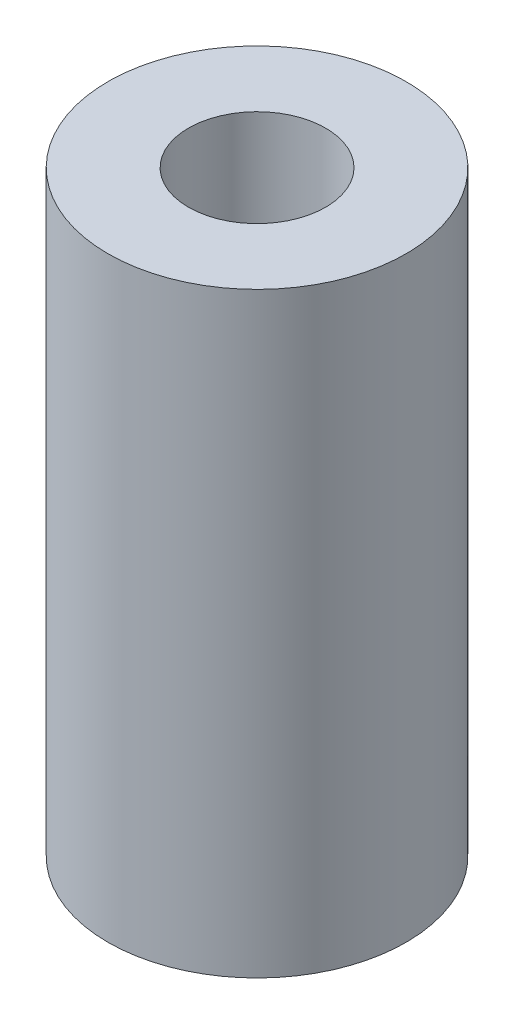
ISO-10303-21;
HEADER;
FILE_DESCRIPTION(('STEP AP214'),'2;1');
FILE_NAME('part.step','',(''),(''),'','','');
FILE_SCHEMA(('AUTOMOTIVE_DESIGN { 1 0 10303 214 1 1 1 1 }'));
ENDSEC;
DATA;
#1=APPLICATION_CONTEXT('core data for automotive mechanical design processes');
#2=APPLICATION_PROTOCOL_DEFINITION('international standard','automotive_design',2000,#1);
#3=PRODUCT_CONTEXT('',#1,'mechanical');
#4=PRODUCT('Part','Part','',(#3));
#5=PRODUCT_RELATED_PRODUCT_CATEGORY('part','',(#4));
#6=PRODUCT_DEFINITION_FORMATION('','',#4);
#7=PRODUCT_DEFINITION_CONTEXT('part definition',#1,'design');
#8=PRODUCT_DEFINITION('design','',#6,#7);
#9=PRODUCT_DEFINITION_SHAPE('','',#8);
#10=(LENGTH_UNIT() NAMED_UNIT(*) SI_UNIT(.MILLI.,.METRE.));
#11=(NAMED_UNIT(*) PLANE_ANGLE_UNIT() SI_UNIT($,.RADIAN.));
#12=(NAMED_UNIT(*) SI_UNIT($,.STERADIAN.) SOLID_ANGLE_UNIT());
#13=UNCERTAINTY_MEASURE_WITH_UNIT(LENGTH_MEASURE(1.E-05),#10,'distance_accuracy_value','');
#14=(GEOMETRIC_REPRESENTATION_CONTEXT(3) GLOBAL_UNCERTAINTY_ASSIGNED_CONTEXT((#13)) GLOBAL_UNIT_ASSIGNED_CONTEXT((#10,
#11,#12)) REPRESENTATION_CONTEXT('',''));
#15=CARTESIAN_POINT('',(0.,0.,0.));
#16=DIRECTION('',(0.,0.,1.));
#17=DIRECTION('',(1.,0.,0.));
#18=AXIS2_PLACEMENT_3D('',#15,#16,#17);
#19=CARTESIAN_POINT('',(0.,10.,0.));
#20=DIRECTION('',(0.,-1.,0.));
#21=DIRECTION('',(0.,0.,-1.));
#22=AXIS2_PLACEMENT_3D('',#19,#20,#21);
#23=CYLINDRICAL_SURFACE('',#22,2.5);
#24=CARTESIAN_POINT('',(0.,10.,0.));
#25=DIRECTION('',(0.,1.,0.));
#26=DIRECTION('',(0.,0.,1.));
#27=AXIS2_PLACEMENT_3D('',#24,#25,#26);
#28=CIRCLE('',#27,2.5);
#29=CARTESIAN_POINT('',(0.,10.,2.5));
#30=VERTEX_POINT('',#29);
#31=EDGE_CURVE('E10',#30,#30,#28,.T.);
#32=ORIENTED_EDGE('',*,*,#31,.F.);
#33=EDGE_LOOP('',(#32));
#34=FACE_BOUND('',#33,.T.);
#35=CARTESIAN_POINT('',(0.,0.,0.));
#36=DIRECTION('',(0.,1.,0.));
#37=DIRECTION('',(0.,0.,1.));
#38=AXIS2_PLACEMENT_3D('',#35,#36,#37);
#39=CIRCLE('',#38,2.5);
#40=CARTESIAN_POINT('',(0.,0.,2.5));
#41=VERTEX_POINT('',#40);
#42=EDGE_CURVE('E40',#41,#41,#39,.T.);
#43=ORIENTED_EDGE('',*,*,#42,.T.);
#44=EDGE_LOOP('',(#43));
#45=FACE_BOUND('',#44,.T.);
#46=ADVANCED_FACE('F37',(#34,#45),#23,.T.);
#47=CARTESIAN_POINT('',(0.,10.,0.));
#48=DIRECTION('',(0.,1.,0.));
#49=DIRECTION('',(0.,0.,1.));
#50=AXIS2_PLACEMENT_3D('',#47,#48,#49);
#51=PLANE('',#50);
#52=CARTESIAN_POINT('',(0.,10.,0.));
#53=DIRECTION('',(0.,1.,0.));
#54=DIRECTION('',(0.,0.,1.));
#55=AXIS2_PLACEMENT_3D('',#52,#53,#54);
#56=CIRCLE('',#55,1.15);
#57=CARTESIAN_POINT('',(0.,10.,1.15));
#58=VERTEX_POINT('',#57);
#59=EDGE_CURVE('E49',#58,#58,#56,.T.);
#60=ORIENTED_EDGE('',*,*,#59,.F.);
#61=EDGE_LOOP('',(#60));
#62=FACE_BOUND('',#61,.T.);
#63=ORIENTED_EDGE('',*,*,#31,.T.);
#64=EDGE_LOOP('',(#63));
#65=FACE_BOUND('',#64,.T.);
#66=ADVANCED_FACE('F64',(#62,#65),#51,.T.);
#67=CARTESIAN_POINT('',(0.,0.,0.));
#68=DIRECTION('',(0.,1.,0.));
#69=DIRECTION('',(0.,0.,1.));
#70=AXIS2_PLACEMENT_3D('',#67,#68,#69);
#71=PLANE('',#70);
#72=ORIENTED_EDGE('',*,*,#42,.F.);
#73=EDGE_LOOP('',(#72));
#74=FACE_BOUND('',#73,.T.);
#75=ADVANCED_FACE('F60',(#74),#71,.F.);
#76=CARTESIAN_POINT('',(0.,2.,0.));
#77=DIRECTION('',(0.,1.,0.));
#78=DIRECTION('',(0.,0.,1.));
#79=AXIS2_PLACEMENT_3D('',#76,#77,#78);
#80=CYLINDRICAL_SURFACE('',#79,1.15);
#81=CARTESIAN_POINT('',(0.,2.,0.));
#82=DIRECTION('',(0.,1.,0.));
#83=DIRECTION('',(0.,0.,1.));
#84=AXIS2_PLACEMENT_3D('',#81,#82,#83);
#85=CIRCLE('',#84,1.15);
#86=CARTESIAN_POINT('',(0.,2.,1.15));
#87=VERTEX_POINT('',#86);
#88=EDGE_CURVE('E47',#87,#87,#85,.T.);
#89=ORIENTED_EDGE('',*,*,#88,.F.);
#90=EDGE_LOOP('',(#89));
#91=FACE_BOUND('',#90,.T.);
#92=ORIENTED_EDGE('',*,*,#59,.T.);
#93=EDGE_LOOP('',(#92));
#94=FACE_BOUND('',#93,.T.);
#95=ADVANCED_FACE('F57',(#91,#94),#80,.F.);
#96=CARTESIAN_POINT('',(0.,2.,0.));
#97=DIRECTION('',(0.,1.,0.));
#98=DIRECTION('',(0.,0.,1.));
#99=AXIS2_PLACEMENT_3D('',#96,#97,#98);
#100=PLANE('',#99);
#101=ORIENTED_EDGE('',*,*,#88,.T.);
#102=EDGE_LOOP('',(#101));
#103=FACE_BOUND('',#102,.T.);
#104=ADVANCED_FACE('F55',(#103),#100,.T.);
#105=CLOSED_SHELL('',(#46,#66,#75,#95,#104));
#106=MANIFOLD_SOLID_BREP('B2',#105);
#107=ADVANCED_BREP_SHAPE_REPRESENTATION('',(#18,#106),#14);
#108=SHAPE_DEFINITION_REPRESENTATION(#9,#107);
ENDSEC;
END-ISO-10303-21;
